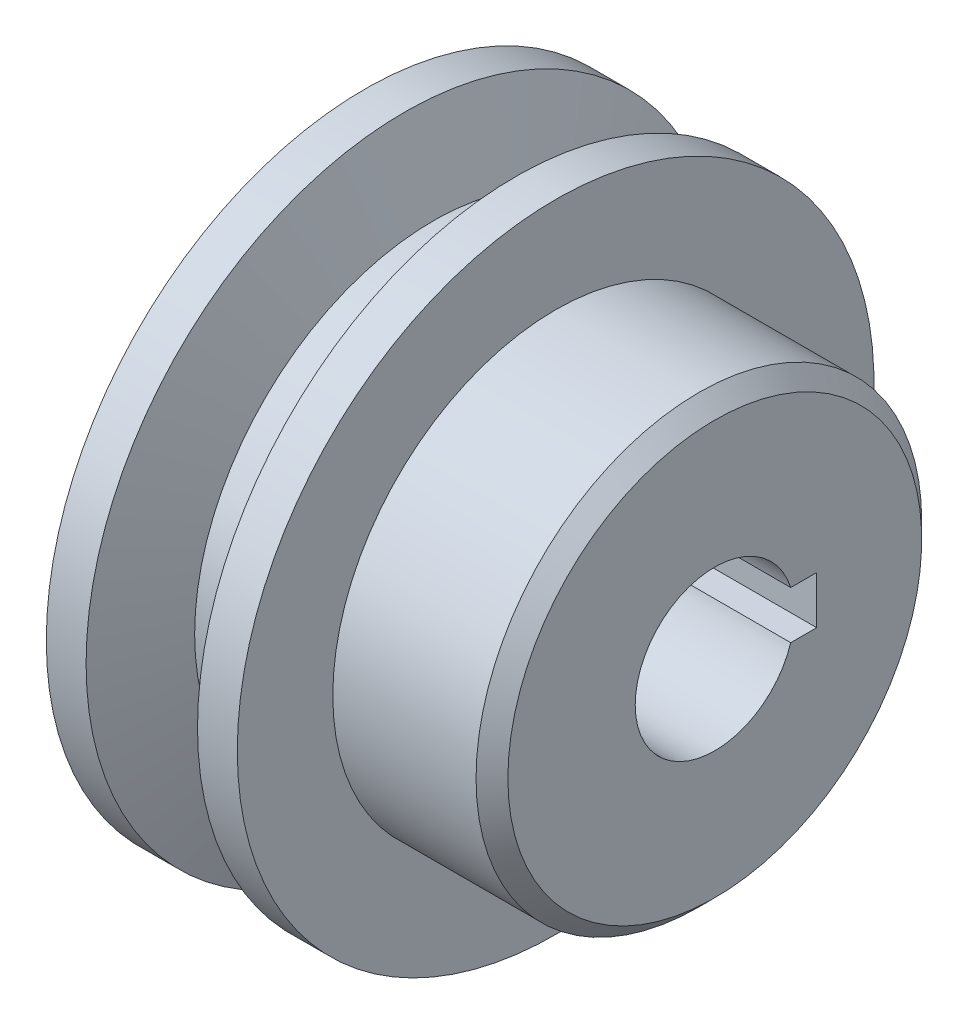
ISO-10303-21;
HEADER;
FILE_DESCRIPTION(('STEP AP214'),'2;1');
FILE_NAME('part.step','',(''),(''),'','','');
FILE_SCHEMA(('AUTOMOTIVE_DESIGN { 1 0 10303 214 1 1 1 1 }'));
ENDSEC;
DATA;
#1=APPLICATION_CONTEXT('core data for automotive mechanical design processes');
#2=APPLICATION_PROTOCOL_DEFINITION('international standard','automotive_design',2000,#1);
#3=PRODUCT_CONTEXT('',#1,'mechanical');
#4=PRODUCT('Part','Part','',(#3));
#5=PRODUCT_RELATED_PRODUCT_CATEGORY('part','',(#4));
#6=PRODUCT_DEFINITION_FORMATION('','',#4);
#7=PRODUCT_DEFINITION_CONTEXT('part definition',#1,'design');
#8=PRODUCT_DEFINITION('design','',#6,#7);
#9=PRODUCT_DEFINITION_SHAPE('','',#8);
#10=(LENGTH_UNIT() NAMED_UNIT(*) SI_UNIT(.MILLI.,.METRE.));
#11=(NAMED_UNIT(*) PLANE_ANGLE_UNIT() SI_UNIT($,.RADIAN.));
#12=(NAMED_UNIT(*) SI_UNIT($,.STERADIAN.) SOLID_ANGLE_UNIT());
#13=UNCERTAINTY_MEASURE_WITH_UNIT(LENGTH_MEASURE(1.E-05),#10,'distance_accuracy_value','');
#14=(GEOMETRIC_REPRESENTATION_CONTEXT(3) GLOBAL_UNCERTAINTY_ASSIGNED_CONTEXT((#13)) GLOBAL_UNIT_ASSIGNED_CONTEXT((#10,
#11,#12)) REPRESENTATION_CONTEXT('',''));
#15=CARTESIAN_POINT('',(0.,0.,0.));
#16=DIRECTION('',(0.,0.,1.));
#17=DIRECTION('',(1.,0.,0.));
#18=AXIS2_PLACEMENT_3D('',#15,#16,#17);
#19=CARTESIAN_POINT('',(0.,20.0000001066825,0.));
#20=DIRECTION('',(1.,0.,0.));
#21=DIRECTION('',(0.,0.,-1.));
#22=AXIS2_PLACEMENT_3D('',#19,#20,#21);
#23=PLANE('',#22);
#24=DIRECTION('',(0.,1.,0.));
#25=VECTOR('',#24,1.);
#26=CARTESIAN_POINT('',(0.,1.5,-6.4));
#27=LINE('',#26,#25);
#28=CARTESIAN_POINT('',(0.,-1.5,-6.4));
#29=VERTEX_POINT('',#28);
#30=CARTESIAN_POINT('',(0.,1.5,-6.4));
#31=VERTEX_POINT('',#30);
#32=EDGE_CURVE('E91',#29,#31,#27,.T.);
#33=ORIENTED_EDGE('',*,*,#32,.T.);
#34=DIRECTION('',(0.,0.,1.));
#35=VECTOR('',#34,1.);
#36=CARTESIAN_POINT('',(0.,1.5,-6.4));
#37=LINE('',#36,#35);
#38=CARTESIAN_POINT('',(0.,1.5,-4.76969600708473));
#39=VERTEX_POINT('',#38);
#40=EDGE_CURVE('E85',#31,#39,#37,.T.);
#41=ORIENTED_EDGE('',*,*,#40,.T.);
#42=CARTESIAN_POINT('',(0.,0.,0.));
#43=DIRECTION('',(1.,0.,0.));
#44=DIRECTION('',(0.,0.,-1.));
#45=AXIS2_PLACEMENT_3D('',#42,#43,#44);
#46=CIRCLE('',#45,5.);
#47=CARTESIAN_POINT('',(0.,-1.5,-4.76969600708473));
#48=VERTEX_POINT('',#47);
#49=EDGE_CURVE('E94',#39,#48,#46,.T.);
#50=ORIENTED_EDGE('',*,*,#49,.T.);
#51=DIRECTION('',(0.,0.,-1.));
#52=VECTOR('',#51,1.);
#53=CARTESIAN_POINT('',(0.,-1.5,-6.4));
#54=LINE('',#53,#52);
#55=EDGE_CURVE('E57',#48,#29,#54,.T.);
#56=ORIENTED_EDGE('',*,*,#55,.T.);
#57=EDGE_LOOP('',(#33,#41,#50,#56));
#58=FACE_BOUND('',#57,.T.);
#59=CARTESIAN_POINT('',(0.,0.,0.));
#60=DIRECTION('',(-1.,0.,0.));
#61=DIRECTION('',(0.,0.,1.));
#62=AXIS2_PLACEMENT_3D('',#59,#60,#61);
#63=CIRCLE('',#62,20.0000001066825);
#64=CARTESIAN_POINT('',(0.,0.,20.0000001066825));
#65=VERTEX_POINT('',#64);
#66=EDGE_CURVE('E115',#65,#65,#63,.T.);
#67=ORIENTED_EDGE('',*,*,#66,.T.);
#68=EDGE_LOOP('',(#67));
#69=FACE_BOUND('',#68,.T.);
#70=ADVANCED_FACE('F41',(#58,#69),#23,.F.);
#71=CARTESIAN_POINT('',(22.,0.,0.));
#72=DIRECTION('',(-1.,0.,0.));
#73=DIRECTION('',(0.,0.,1.));
#74=AXIS2_PLACEMENT_3D('',#71,#72,#73);
#75=PLANE('',#74);
#76=CARTESIAN_POINT('',(22.,0.,0.));
#77=DIRECTION('',(-1.,0.,0.));
#78=DIRECTION('',(0.,0.,1.));
#79=AXIS2_PLACEMENT_3D('',#76,#77,#78);
#80=CIRCLE('',#79,13.);
#81=CARTESIAN_POINT('',(22.,0.,13.));
#82=VERTEX_POINT('',#81);
#83=EDGE_CURVE('E11',#82,#82,#80,.F.);
#84=ORIENTED_EDGE('',*,*,#83,.T.);
#85=EDGE_LOOP('',(#84));
#86=FACE_BOUND('',#85,.T.);
#87=CARTESIAN_POINT('',(22.,0.,0.));
#88=DIRECTION('',(1.,0.,0.));
#89=DIRECTION('',(0.,0.,-1.));
#90=AXIS2_PLACEMENT_3D('',#87,#88,#89);
#91=CIRCLE('',#90,5.);
#92=CARTESIAN_POINT('',(22.,1.5,-4.76969600708473));
#93=VERTEX_POINT('',#92);
#94=CARTESIAN_POINT('',(22.,-1.5,-4.76969600708473));
#95=VERTEX_POINT('',#94);
#96=EDGE_CURVE('E109',#93,#95,#91,.T.);
#97=ORIENTED_EDGE('',*,*,#96,.F.);
#98=DIRECTION('',(0.,0.,1.));
#99=VECTOR('',#98,1.);
#100=CARTESIAN_POINT('',(22.,1.5,-6.4));
#101=LINE('',#100,#99);
#102=CARTESIAN_POINT('',(22.,1.5,-6.4));
#103=VERTEX_POINT('',#102);
#104=EDGE_CURVE('E65',#103,#93,#101,.T.);
#105=ORIENTED_EDGE('',*,*,#104,.F.);
#106=DIRECTION('',(0.,1.,0.));
#107=VECTOR('',#106,1.);
#108=CARTESIAN_POINT('',(22.,1.5,-6.4));
#109=LINE('',#108,#107);
#110=CARTESIAN_POINT('',(22.,-1.5,-6.4));
#111=VERTEX_POINT('',#110);
#112=EDGE_CURVE('E100',#111,#103,#109,.T.);
#113=ORIENTED_EDGE('',*,*,#112,.F.);
#114=DIRECTION('',(0.,0.,-1.));
#115=VECTOR('',#114,1.);
#116=CARTESIAN_POINT('',(22.,-1.5,-6.4));
#117=LINE('',#116,#115);
#118=EDGE_CURVE('E103',#95,#111,#117,.T.);
#119=ORIENTED_EDGE('',*,*,#118,.F.);
#120=EDGE_LOOP('',(#97,#105,#113,#119));
#121=FACE_BOUND('',#120,.T.);
#122=ADVANCED_FACE('F154',(#86,#121),#75,.F.);
#123=CARTESIAN_POINT('',(0.,0.,0.));
#124=DIRECTION('',(-1.,0.,0.));
#125=DIRECTION('',(0.,0.,1.));
#126=AXIS2_PLACEMENT_3D('',#123,#124,#125);
#127=CYLINDRICAL_SURFACE('',#126,14.);
#128=CARTESIAN_POINT('',(21.,0.,0.));
#129=DIRECTION('',(-1.,0.,0.));
#130=DIRECTION('',(0.,0.,1.));
#131=AXIS2_PLACEMENT_3D('',#128,#129,#130);
#132=CIRCLE('',#131,14.);
#133=CARTESIAN_POINT('',(21.,0.,14.));
#134=VERTEX_POINT('',#133);
#135=EDGE_CURVE('E50',#134,#134,#132,.T.);
#136=ORIENTED_EDGE('',*,*,#135,.T.);
#137=EDGE_LOOP('',(#136));
#138=FACE_BOUND('',#137,.T.);
#139=CARTESIAN_POINT('',(12.,0.,0.));
#140=DIRECTION('',(-1.,0.,0.));
#141=DIRECTION('',(0.,0.,1.));
#142=AXIS2_PLACEMENT_3D('',#139,#140,#141);
#143=CIRCLE('',#142,14.);
#144=CARTESIAN_POINT('',(12.,0.,14.));
#145=VERTEX_POINT('',#144);
#146=EDGE_CURVE('E136',#145,#145,#143,.T.);
#147=ORIENTED_EDGE('',*,*,#146,.F.);
#148=EDGE_LOOP('',(#147));
#149=FACE_BOUND('',#148,.T.);
#150=ADVANCED_FACE('F141',(#138,#149),#127,.T.);
#151=CARTESIAN_POINT('',(12.,14.,0.));
#152=DIRECTION('',(-1.,0.,0.));
#153=DIRECTION('',(0.,0.,1.));
#154=AXIS2_PLACEMENT_3D('',#151,#152,#153);
#155=PLANE('',#154);
#156=CARTESIAN_POINT('',(12.,0.,0.));
#157=DIRECTION('',(-1.,0.,0.));
#158=DIRECTION('',(0.,0.,1.));
#159=AXIS2_PLACEMENT_3D('',#156,#157,#158);
#160=CIRCLE('',#159,20.);
#161=CARTESIAN_POINT('',(12.,0.,20.));
#162=VERTEX_POINT('',#161);
#163=EDGE_CURVE('E133',#162,#162,#160,.T.);
#164=ORIENTED_EDGE('',*,*,#163,.F.);
#165=EDGE_LOOP('',(#164));
#166=FACE_BOUND('',#165,.T.);
#167=ORIENTED_EDGE('',*,*,#146,.T.);
#168=EDGE_LOOP('',(#167));
#169=FACE_BOUND('',#168,.T.);
#170=ADVANCED_FACE('F164',(#166,#169),#155,.F.);
#171=CARTESIAN_POINT('',(0.,0.,0.));
#172=DIRECTION('',(-1.,0.,0.));
#173=DIRECTION('',(0.,0.,1.));
#174=AXIS2_PLACEMENT_3D('',#171,#172,#173);
#175=CYLINDRICAL_SURFACE('',#174,20.);
#176=CARTESIAN_POINT('',(9.5,0.,0.));
#177=DIRECTION('',(-1.,0.,0.));
#178=DIRECTION('',(0.,0.,1.));
#179=AXIS2_PLACEMENT_3D('',#176,#177,#178);
#180=CIRCLE('',#179,20.);
#181=CARTESIAN_POINT('',(9.5,0.,20.));
#182=VERTEX_POINT('',#181);
#183=EDGE_CURVE('E130',#182,#182,#180,.T.);
#184=ORIENTED_EDGE('',*,*,#183,.F.);
#185=EDGE_LOOP('',(#184));
#186=FACE_BOUND('',#185,.T.);
#187=ORIENTED_EDGE('',*,*,#163,.T.);
#188=EDGE_LOOP('',(#187));
#189=FACE_BOUND('',#188,.T.);
#190=ADVANCED_FACE('F167',(#186,#189),#175,.T.);
#191=CARTESIAN_POINT('',(9.5,0.,0.));
#192=DIRECTION('',(1.,0.,0.));
#193=DIRECTION('',(0.,0.,-1.));
#194=AXIS2_PLACEMENT_3D('',#191,#192,#193);
#195=CONICAL_SURFACE('',#194,20.,1.22173044708526);
#196=CARTESIAN_POINT('',(7.68014866270049,0.,0.));
#197=DIRECTION('',(-1.,0.,0.));
#198=DIRECTION('',(0.,0.,1.));
#199=AXIS2_PLACEMENT_3D('',#196,#197,#198);
#200=CIRCLE('',#199,15.);
#201=CARTESIAN_POINT('',(7.68014866270049,0.,15.));
#202=VERTEX_POINT('',#201);
#203=EDGE_CURVE('E127',#202,#202,#200,.T.);
#204=ORIENTED_EDGE('',*,*,#203,.F.);
#205=EDGE_LOOP('',(#204));
#206=FACE_BOUND('',#205,.T.);
#207=ORIENTED_EDGE('',*,*,#183,.T.);
#208=EDGE_LOOP('',(#207));
#209=FACE_BOUND('',#208,.T.);
#210=ADVANCED_FACE('F171',(#206,#209),#195,.T.);
#211=CARTESIAN_POINT('',(0.,0.,0.));
#212=DIRECTION('',(-1.,0.,0.));
#213=DIRECTION('',(0.,0.,1.));
#214=AXIS2_PLACEMENT_3D('',#211,#212,#213);
#215=CYLINDRICAL_SURFACE('',#214,15.);
#216=CARTESIAN_POINT('',(4.31985104419174,0.,0.));
#217=DIRECTION('',(-1.,0.,0.));
#218=DIRECTION('',(0.,0.,1.));
#219=AXIS2_PLACEMENT_3D('',#216,#217,#218);
#220=CIRCLE('',#219,15.);
#221=CARTESIAN_POINT('',(4.31985104419174,0.,15.));
#222=VERTEX_POINT('',#221);
#223=EDGE_CURVE('E124',#222,#222,#220,.T.);
#224=ORIENTED_EDGE('',*,*,#223,.F.);
#225=EDGE_LOOP('',(#224));
#226=FACE_BOUND('',#225,.T.);
#227=ORIENTED_EDGE('',*,*,#203,.T.);
#228=EDGE_LOOP('',(#227));
#229=FACE_BOUND('',#228,.T.);
#230=ADVANCED_FACE('F175',(#226,#229),#215,.T.);
#231=CARTESIAN_POINT('',(4.31985104419174,0.,0.));
#232=DIRECTION('',(-1.,0.,0.));
#233=DIRECTION('',(0.,0.,1.));
#234=AXIS2_PLACEMENT_3D('',#231,#232,#233);
#235=CONICAL_SURFACE('',#234,15.,1.22173050570681);
#236=CARTESIAN_POINT('',(2.5,0.,0.));
#237=DIRECTION('',(-1.,0.,0.));
#238=DIRECTION('',(0.,0.,1.));
#239=AXIS2_PLACEMENT_3D('',#236,#237,#238);
#240=CIRCLE('',#239,20.0000001066825);
#241=CARTESIAN_POINT('',(2.5,0.,20.0000001066825));
#242=VERTEX_POINT('',#241);
#243=EDGE_CURVE('E121',#242,#242,#240,.T.);
#244=ORIENTED_EDGE('',*,*,#243,.F.);
#245=EDGE_LOOP('',(#244));
#246=FACE_BOUND('',#245,.T.);
#247=ORIENTED_EDGE('',*,*,#223,.T.);
#248=EDGE_LOOP('',(#247));
#249=FACE_BOUND('',#248,.T.);
#250=ADVANCED_FACE('F179',(#246,#249),#235,.T.);
#251=CARTESIAN_POINT('',(0.,0.,0.));
#252=DIRECTION('',(-1.,0.,0.));
#253=DIRECTION('',(0.,0.,1.));
#254=AXIS2_PLACEMENT_3D('',#251,#252,#253);
#255=CYLINDRICAL_SURFACE('',#254,20.0000001066825);
#256=ORIENTED_EDGE('',*,*,#66,.F.);
#257=EDGE_LOOP('',(#256));
#258=FACE_BOUND('',#257,.T.);
#259=ORIENTED_EDGE('',*,*,#243,.T.);
#260=EDGE_LOOP('',(#259));
#261=FACE_BOUND('',#260,.T.);
#262=ADVANCED_FACE('F183',(#258,#261),#255,.T.);
#263=CARTESIAN_POINT('',(0.,1.5,-6.4));
#264=DIRECTION('',(0.,1.,0.));
#265=DIRECTION('',(0.,0.,1.));
#266=AXIS2_PLACEMENT_3D('',#263,#264,#265);
#267=PLANE('',#266);
#268=ORIENTED_EDGE('',*,*,#104,.T.);
#269=DIRECTION('',(1.,0.,0.));
#270=VECTOR('',#269,1.);
#271=CARTESIAN_POINT('',(0.,1.5,-4.76969600708473));
#272=LINE('',#271,#270);
#273=EDGE_CURVE('E81',#39,#93,#272,.T.);
#274=ORIENTED_EDGE('',*,*,#273,.F.);
#275=ORIENTED_EDGE('',*,*,#40,.F.);
#276=DIRECTION('',(1.,0.,0.));
#277=VECTOR('',#276,1.);
#278=CARTESIAN_POINT('',(0.,1.5,-6.4));
#279=LINE('',#278,#277);
#280=EDGE_CURVE('E113',#31,#103,#279,.T.);
#281=ORIENTED_EDGE('',*,*,#280,.T.);
#282=EDGE_LOOP('',(#268,#274,#275,#281));
#283=FACE_BOUND('',#282,.T.);
#284=ADVANCED_FACE('F83',(#283),#267,.F.);
#285=CARTESIAN_POINT('',(0.,1.5,-6.4));
#286=DIRECTION('',(0.,0.,-1.));
#287=DIRECTION('',(-1.,0.,0.));
#288=AXIS2_PLACEMENT_3D('',#285,#286,#287);
#289=PLANE('',#288);
#290=ORIENTED_EDGE('',*,*,#112,.T.);
#291=ORIENTED_EDGE('',*,*,#280,.F.);
#292=ORIENTED_EDGE('',*,*,#32,.F.);
#293=DIRECTION('',(1.,0.,0.));
#294=VECTOR('',#293,1.);
#295=CARTESIAN_POINT('',(0.,-1.5,-6.4));
#296=LINE('',#295,#294);
#297=EDGE_CURVE('E116',#29,#111,#296,.T.);
#298=ORIENTED_EDGE('',*,*,#297,.T.);
#299=EDGE_LOOP('',(#290,#291,#292,#298));
#300=FACE_BOUND('',#299,.T.);
#301=ADVANCED_FACE('F187',(#300),#289,.F.);
#302=CARTESIAN_POINT('',(0.,-1.5,-6.4));
#303=DIRECTION('',(0.,-1.,0.));
#304=DIRECTION('',(0.,0.,-1.));
#305=AXIS2_PLACEMENT_3D('',#302,#303,#304);
#306=PLANE('',#305);
#307=ORIENTED_EDGE('',*,*,#118,.T.);
#308=ORIENTED_EDGE('',*,*,#297,.F.);
#309=ORIENTED_EDGE('',*,*,#55,.F.);
#310=DIRECTION('',(1.,0.,0.));
#311=VECTOR('',#310,1.);
#312=CARTESIAN_POINT('',(0.,-1.5,-4.76969600708473));
#313=LINE('',#312,#311);
#314=EDGE_CURVE('E90',#48,#95,#313,.T.);
#315=ORIENTED_EDGE('',*,*,#314,.T.);
#316=EDGE_LOOP('',(#307,#308,#309,#315));
#317=FACE_BOUND('',#316,.T.);
#318=ADVANCED_FACE('F150',(#317),#306,.F.);
#319=CARTESIAN_POINT('',(0.,0.,0.));
#320=DIRECTION('',(1.,0.,0.));
#321=DIRECTION('',(0.,0.,-1.));
#322=AXIS2_PLACEMENT_3D('',#319,#320,#321);
#323=CYLINDRICAL_SURFACE('',#322,5.);
#324=ORIENTED_EDGE('',*,*,#96,.T.);
#325=ORIENTED_EDGE('',*,*,#314,.F.);
#326=ORIENTED_EDGE('',*,*,#49,.F.);
#327=ORIENTED_EDGE('',*,*,#273,.T.);
#328=EDGE_LOOP('',(#324,#325,#326,#327));
#329=FACE_BOUND('',#328,.T.);
#330=ADVANCED_FACE('F95',(#329),#323,.F.);
#331=CARTESIAN_POINT('',(21.,0.,0.));
#332=DIRECTION('',(-1.,0.,0.));
#333=DIRECTION('',(0.,0.,1.));
#334=AXIS2_PLACEMENT_3D('',#331,#332,#333);
#335=CONICAL_SURFACE('',#334,14.,0.785398163397453);
#336=ORIENTED_EDGE('',*,*,#83,.F.);
#337=EDGE_LOOP('',(#336));
#338=FACE_BOUND('',#337,.T.);
#339=ORIENTED_EDGE('',*,*,#135,.F.);
#340=EDGE_LOOP('',(#339));
#341=FACE_BOUND('',#340,.T.);
#342=ADVANCED_FACE('F44',(#338,#341),#335,.T.);
#343=CLOSED_SHELL('',(#70,#122,#150,#170,#190,#210,#230,#250,#262,#284,#301,#318,#330,#342));
#344=MANIFOLD_SOLID_BREP('B2',#343);
#345=ADVANCED_BREP_SHAPE_REPRESENTATION('',(#18,#344),#14);
#346=SHAPE_DEFINITION_REPRESENTATION(#9,#345);
ENDSEC;
END-ISO-10303-21;
